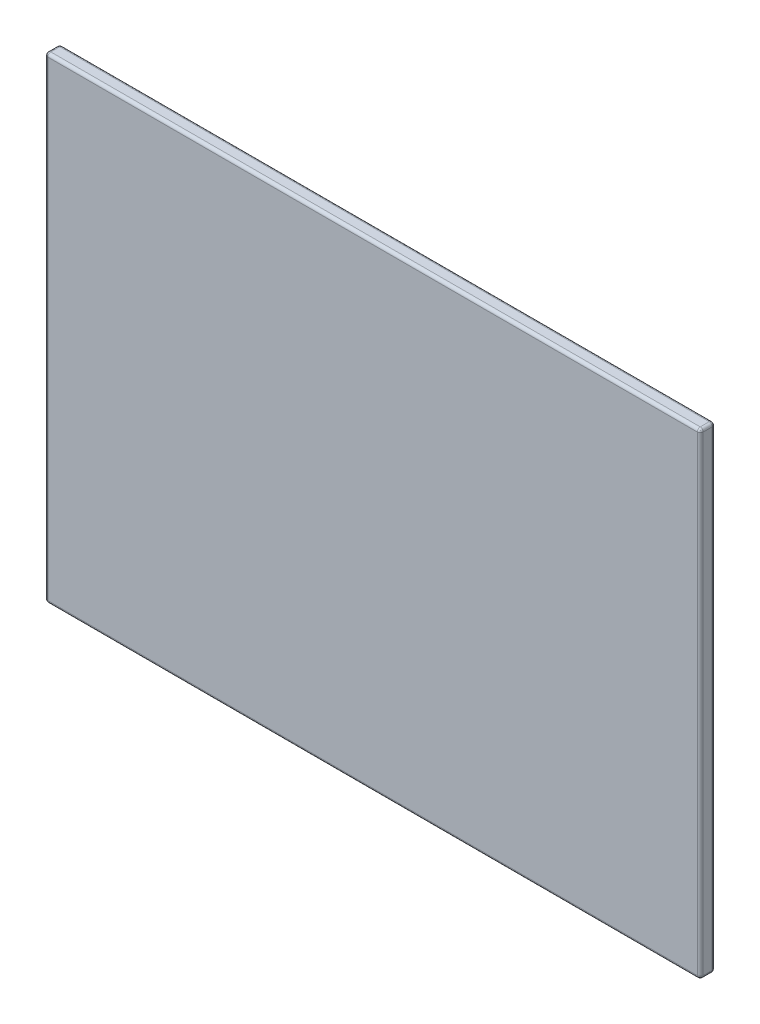
ISO-10303-21;
HEADER;
FILE_DESCRIPTION(('STEP AP214'),'2;1');
FILE_NAME('part.step','',(''),(''),'','','');
FILE_SCHEMA(('AUTOMOTIVE_DESIGN { 1 0 10303 214 1 1 1 1 }'));
ENDSEC;
DATA;
#1=APPLICATION_CONTEXT('core data for automotive mechanical design processes');
#2=APPLICATION_PROTOCOL_DEFINITION('international standard','automotive_design',2000,#1);
#3=PRODUCT_CONTEXT('',#1,'mechanical');
#4=PRODUCT('Part','Part','',(#3));
#5=PRODUCT_RELATED_PRODUCT_CATEGORY('part','',(#4));
#6=PRODUCT_DEFINITION_FORMATION('','',#4);
#7=PRODUCT_DEFINITION_CONTEXT('part definition',#1,'design');
#8=PRODUCT_DEFINITION('design','',#6,#7);
#9=PRODUCT_DEFINITION_SHAPE('','',#8);
#10=(LENGTH_UNIT() NAMED_UNIT(*) SI_UNIT(.MILLI.,.METRE.));
#11=(NAMED_UNIT(*) PLANE_ANGLE_UNIT() SI_UNIT($,.RADIAN.));
#12=(NAMED_UNIT(*) SI_UNIT($,.STERADIAN.) SOLID_ANGLE_UNIT());
#13=UNCERTAINTY_MEASURE_WITH_UNIT(LENGTH_MEASURE(1.E-05),#10,'distance_accuracy_value','');
#14=(GEOMETRIC_REPRESENTATION_CONTEXT(3) GLOBAL_UNCERTAINTY_ASSIGNED_CONTEXT((#13)) GLOBAL_UNIT_ASSIGNED_CONTEXT((#10,
#11,#12)) REPRESENTATION_CONTEXT('',''));
#15=CARTESIAN_POINT('',(0.,0.,0.));
#16=DIRECTION('',(0.,0.,1.));
#17=DIRECTION('',(1.,0.,0.));
#18=AXIS2_PLACEMENT_3D('',#15,#16,#17);
#19=CARTESIAN_POINT('',(-1.09,-0.79,0.04));
#20=DIRECTION('',(-0.577350269189626,-0.577350269189626,0.577350269189626));
#21=DIRECTION('',(0.,0.707106781186548,0.707106781186548));
#22=AXIS2_PLACEMENT_3D('',#19,#20,#21);
#23=SPHERICAL_SURFACE('',#22,0.01);
#24=CARTESIAN_POINT('',(-1.0957735026919,-0.795773502691896,0.0457735026918962));
#25=VERTEX_POINT('',#24);
#26=VERTEX_LOOP('',#25);
#27=FACE_BOUND('',#26,.T.);
#28=CARTESIAN_POINT('',(-1.09,-0.79,0.04));
#29=DIRECTION('',(0.,0.,1.));
#30=DIRECTION('',(1.,0.,0.));
#31=AXIS2_PLACEMENT_3D('',#28,#29,#30);
#32=CIRCLE('',#31,0.01);
#33=CARTESIAN_POINT('',(-1.09,-0.8,0.04));
#34=VERTEX_POINT('',#33);
#35=CARTESIAN_POINT('',(-1.1,-0.79,0.04));
#36=VERTEX_POINT('',#35);
#37=EDGE_CURVE('E111',#34,#36,#32,.F.);
#38=ORIENTED_EDGE('',*,*,#37,.F.);
#39=CARTESIAN_POINT('',(-1.09,-0.79,0.04));
#40=DIRECTION('',(1.,0.,0.));
#41=DIRECTION('',(0.,1.,0.));
#42=AXIS2_PLACEMENT_3D('',#39,#40,#41);
#43=CIRCLE('',#42,0.01);
#44=CARTESIAN_POINT('',(-1.09,-0.79,0.05));
#45=VERTEX_POINT('',#44);
#46=EDGE_CURVE('E122',#45,#34,#43,.T.);
#47=ORIENTED_EDGE('',*,*,#46,.F.);
#48=CARTESIAN_POINT('',(-1.09,-0.79,0.04));
#49=DIRECTION('',(0.,-1.,0.));
#50=DIRECTION('',(1.,0.,0.));
#51=AXIS2_PLACEMENT_3D('',#48,#49,#50);
#52=CIRCLE('',#51,0.01);
#53=EDGE_CURVE('E20',#36,#45,#52,.F.);
#54=ORIENTED_EDGE('',*,*,#53,.F.);
#55=EDGE_LOOP('',(#38,#47,#54));
#56=FACE_BOUND('',#55,.T.);
#57=ADVANCED_FACE('F16',(#27,#56),#23,.T.);
#58=CARTESIAN_POINT('',(1.09,-0.79,0.04));
#59=DIRECTION('',(0.577350269189626,-0.577350269189626,0.577350269189626));
#60=DIRECTION('',(0.,0.707106781186548,0.707106781186548));
#61=AXIS2_PLACEMENT_3D('',#58,#59,#60);
#62=SPHERICAL_SURFACE('',#61,0.01);
#63=CARTESIAN_POINT('',(1.0957735026919,-0.795773502691896,0.0457735026918962));
#64=VERTEX_POINT('',#63);
#65=VERTEX_LOOP('',#64);
#66=FACE_BOUND('',#65,.T.);
#67=CARTESIAN_POINT('',(1.09,-0.79,0.04));
#68=DIRECTION('',(0.,0.,1.));
#69=DIRECTION('',(1.,0.,0.));
#70=AXIS2_PLACEMENT_3D('',#67,#68,#69);
#71=CIRCLE('',#70,0.01);
#72=CARTESIAN_POINT('',(1.1,-0.79,0.04));
#73=VERTEX_POINT('',#72);
#74=CARTESIAN_POINT('',(1.09,-0.8,0.04));
#75=VERTEX_POINT('',#74);
#76=EDGE_CURVE('E223',#73,#75,#71,.F.);
#77=ORIENTED_EDGE('',*,*,#76,.F.);
#78=CARTESIAN_POINT('',(1.09,-0.79,0.04));
#79=DIRECTION('',(0.,1.,0.));
#80=DIRECTION('',(-1.,0.,0.));
#81=AXIS2_PLACEMENT_3D('',#78,#79,#80);
#82=CIRCLE('',#81,0.01);
#83=CARTESIAN_POINT('',(1.09,-0.79,0.05));
#84=VERTEX_POINT('',#83);
#85=EDGE_CURVE('E174',#84,#73,#82,.T.);
#86=ORIENTED_EDGE('',*,*,#85,.F.);
#87=CARTESIAN_POINT('',(1.09,-0.79,0.04));
#88=DIRECTION('',(1.,0.,0.));
#89=DIRECTION('',(0.,1.,0.));
#90=AXIS2_PLACEMENT_3D('',#87,#88,#89);
#91=CIRCLE('',#90,0.01);
#92=EDGE_CURVE('E179',#75,#84,#91,.F.);
#93=ORIENTED_EDGE('',*,*,#92,.F.);
#94=EDGE_LOOP('',(#77,#86,#93));
#95=FACE_BOUND('',#94,.T.);
#96=ADVANCED_FACE('F166',(#66,#95),#62,.T.);
#97=CARTESIAN_POINT('',(-1.09,0.79,0.04));
#98=DIRECTION('',(-0.577350269189626,0.577350269189626,0.577350269189626));
#99=DIRECTION('',(0.,0.707106781186548,-0.707106781186548));
#100=AXIS2_PLACEMENT_3D('',#97,#98,#99);
#101=SPHERICAL_SURFACE('',#100,0.01);
#102=CARTESIAN_POINT('',(-1.0957735026919,0.795773502691896,0.0457735026918962));
#103=VERTEX_POINT('',#102);
#104=VERTEX_LOOP('',#103);
#105=FACE_BOUND('',#104,.T.);
#106=CARTESIAN_POINT('',(-1.09,0.79,0.04));
#107=DIRECTION('',(0.,0.,1.));
#108=DIRECTION('',(1.,0.,0.));
#109=AXIS2_PLACEMENT_3D('',#106,#107,#108);
#110=CIRCLE('',#109,0.01);
#111=CARTESIAN_POINT('',(-1.1,0.79,0.04));
#112=VERTEX_POINT('',#111);
#113=CARTESIAN_POINT('',(-1.09,0.8,0.04));
#114=VERTEX_POINT('',#113);
#115=EDGE_CURVE('E221',#112,#114,#110,.F.);
#116=ORIENTED_EDGE('',*,*,#115,.F.);
#117=CARTESIAN_POINT('',(-1.09,0.79,0.04));
#118=DIRECTION('',(0.,-1.,0.));
#119=DIRECTION('',(1.,0.,0.));
#120=AXIS2_PLACEMENT_3D('',#117,#118,#119);
#121=CIRCLE('',#120,0.01);
#122=CARTESIAN_POINT('',(-1.09,0.79,0.05));
#123=VERTEX_POINT('',#122);
#124=EDGE_CURVE('E140',#123,#112,#121,.T.);
#125=ORIENTED_EDGE('',*,*,#124,.F.);
#126=CARTESIAN_POINT('',(-1.09,0.79,0.04));
#127=DIRECTION('',(-1.,0.,0.));
#128=DIRECTION('',(0.,-1.,0.));
#129=AXIS2_PLACEMENT_3D('',#126,#127,#128);
#130=CIRCLE('',#129,0.01);
#131=EDGE_CURVE('E218',#114,#123,#130,.F.);
#132=ORIENTED_EDGE('',*,*,#131,.F.);
#133=EDGE_LOOP('',(#116,#125,#132));
#134=FACE_BOUND('',#133,.T.);
#135=ADVANCED_FACE('F163',(#105,#134),#101,.T.);
#136=CARTESIAN_POINT('',(0.,0.,0.05));
#137=DIRECTION('',(0.,0.,1.));
#138=DIRECTION('',(1.,0.,0.));
#139=AXIS2_PLACEMENT_3D('',#136,#137,#138);
#140=PLANE('',#139);
#141=DIRECTION('',(0.,1.,0.));
#142=VECTOR('',#141,1.);
#143=CARTESIAN_POINT('',(1.09,-0.4,0.05));
#144=LINE('',#143,#142);
#145=CARTESIAN_POINT('',(1.09,0.79,0.05));
#146=VERTEX_POINT('',#145);
#147=EDGE_CURVE('E172',#146,#84,#144,.F.);
#148=ORIENTED_EDGE('',*,*,#147,.F.);
#149=DIRECTION('',(-1.,0.,0.));
#150=VECTOR('',#149,1.);
#151=CARTESIAN_POINT('',(0.55,0.79,0.05));
#152=LINE('',#151,#150);
#153=EDGE_CURVE('E151',#123,#146,#152,.F.);
#154=ORIENTED_EDGE('',*,*,#153,.F.);
#155=DIRECTION('',(0.,-1.,0.));
#156=VECTOR('',#155,1.);
#157=CARTESIAN_POINT('',(-1.09,0.4,0.05));
#158=LINE('',#157,#156);
#159=EDGE_CURVE('E137',#45,#123,#158,.F.);
#160=ORIENTED_EDGE('',*,*,#159,.F.);
#161=DIRECTION('',(1.,0.,0.));
#162=VECTOR('',#161,1.);
#163=CARTESIAN_POINT('',(-0.55,-0.79,0.05));
#164=LINE('',#163,#162);
#165=EDGE_CURVE('E177',#84,#45,#164,.F.);
#166=ORIENTED_EDGE('',*,*,#165,.F.);
#167=EDGE_LOOP('',(#148,#154,#160,#166));
#168=FACE_BOUND('',#167,.T.);
#169=ADVANCED_FACE('F158',(#168),#140,.T.);
#170=CARTESIAN_POINT('',(1.09,0.79,0.04));
#171=DIRECTION('',(0.577350269189626,0.577350269189626,0.577350269189626));
#172=DIRECTION('',(0.,0.707106781186548,-0.707106781186548));
#173=AXIS2_PLACEMENT_3D('',#170,#171,#172);
#174=SPHERICAL_SURFACE('',#173,0.01);
#175=CARTESIAN_POINT('',(1.0957735026919,0.795773502691896,0.0457735026918962));
#176=VERTEX_POINT('',#175);
#177=VERTEX_LOOP('',#176);
#178=FACE_BOUND('',#177,.T.);
#179=CARTESIAN_POINT('',(1.09,0.79,0.04));
#180=DIRECTION('',(0.,0.,1.));
#181=DIRECTION('',(1.,0.,0.));
#182=AXIS2_PLACEMENT_3D('',#179,#180,#181);
#183=CIRCLE('',#182,0.01);
#184=CARTESIAN_POINT('',(1.09,0.8,0.04));
#185=VERTEX_POINT('',#184);
#186=CARTESIAN_POINT('',(1.1,0.79,0.04));
#187=VERTEX_POINT('',#186);
#188=EDGE_CURVE('E132',#185,#187,#183,.F.);
#189=ORIENTED_EDGE('',*,*,#188,.F.);
#190=CARTESIAN_POINT('',(1.09,0.79,0.04));
#191=DIRECTION('',(-1.,0.,0.));
#192=DIRECTION('',(0.,-1.,0.));
#193=AXIS2_PLACEMENT_3D('',#190,#191,#192);
#194=CIRCLE('',#193,0.01);
#195=EDGE_CURVE('E216',#146,#185,#194,.T.);
#196=ORIENTED_EDGE('',*,*,#195,.F.);
#197=CARTESIAN_POINT('',(1.09,0.79,0.04));
#198=DIRECTION('',(0.,1.,0.));
#199=DIRECTION('',(-1.,0.,0.));
#200=AXIS2_PLACEMENT_3D('',#197,#198,#199);
#201=CIRCLE('',#200,0.01);
#202=EDGE_CURVE('E121',#187,#146,#201,.F.);
#203=ORIENTED_EDGE('',*,*,#202,.F.);
#204=EDGE_LOOP('',(#189,#196,#203));
#205=FACE_BOUND('',#204,.T.);
#206=ADVANCED_FACE('F154',(#178,#205),#174,.T.);
#207=CARTESIAN_POINT('',(-1.09,0.4,0.04));
#208=DIRECTION('',(0.,-1.,0.));
#209=DIRECTION('',(1.,0.,0.));
#210=AXIS2_PLACEMENT_3D('',#207,#208,#209);
#211=CYLINDRICAL_SURFACE('',#210,0.01);
#212=ORIENTED_EDGE('',*,*,#124,.T.);
#213=DIRECTION('',(0.,-1.,0.));
#214=VECTOR('',#213,1.);
#215=CARTESIAN_POINT('',(-1.1,0.8,0.04));
#216=LINE('',#215,#214);
#217=EDGE_CURVE('E128',#36,#112,#216,.F.);
#218=ORIENTED_EDGE('',*,*,#217,.F.);
#219=ORIENTED_EDGE('',*,*,#53,.T.);
#220=ORIENTED_EDGE('',*,*,#159,.T.);
#221=EDGE_LOOP('',(#212,#218,#219,#220));
#222=FACE_BOUND('',#221,.T.);
#223=ADVANCED_FACE('F138',(#222),#211,.T.);
#224=CARTESIAN_POINT('',(-0.55,-0.79,0.04));
#225=DIRECTION('',(1.,0.,0.));
#226=DIRECTION('',(0.,1.,0.));
#227=AXIS2_PLACEMENT_3D('',#224,#225,#226);
#228=CYLINDRICAL_SURFACE('',#227,0.01);
#229=ORIENTED_EDGE('',*,*,#46,.T.);
#230=DIRECTION('',(1.,0.,0.));
#231=VECTOR('',#230,1.);
#232=CARTESIAN_POINT('',(-1.1,-0.8,0.04));
#233=LINE('',#232,#231);
#234=EDGE_CURVE('E147',#75,#34,#233,.F.);
#235=ORIENTED_EDGE('',*,*,#234,.F.);
#236=ORIENTED_EDGE('',*,*,#92,.T.);
#237=ORIENTED_EDGE('',*,*,#165,.T.);
#238=EDGE_LOOP('',(#229,#235,#236,#237));
#239=FACE_BOUND('',#238,.T.);
#240=ADVANCED_FACE('F232',(#239),#228,.T.);
#241=CARTESIAN_POINT('',(-1.09,-0.79,0.));
#242=DIRECTION('',(0.,0.,1.));
#243=DIRECTION('',(1.,0.,0.));
#244=AXIS2_PLACEMENT_3D('',#241,#242,#243);
#245=CYLINDRICAL_SURFACE('',#244,0.01);
#246=CARTESIAN_POINT('',(-1.09,-0.79,0.01));
#247=DIRECTION('',(0.,0.,1.));
#248=DIRECTION('',(1.,0.,0.));
#249=AXIS2_PLACEMENT_3D('',#246,#247,#248);
#250=CIRCLE('',#249,0.01);
#251=CARTESIAN_POINT('',(-1.09,-0.8,0.01));
#252=VERTEX_POINT('',#251);
#253=CARTESIAN_POINT('',(-1.1,-0.79,0.01));
#254=VERTEX_POINT('',#253);
#255=EDGE_CURVE('E143',#252,#254,#250,.F.);
#256=ORIENTED_EDGE('',*,*,#255,.F.);
#257=DIRECTION('',(0.,0.,1.));
#258=VECTOR('',#257,1.);
#259=CARTESIAN_POINT('',(-1.09,-0.8,0.));
#260=LINE('',#259,#258);
#261=EDGE_CURVE('E117',#34,#252,#260,.F.);
#262=ORIENTED_EDGE('',*,*,#261,.F.);
#263=ORIENTED_EDGE('',*,*,#37,.T.);
#264=DIRECTION('',(0.,0.,1.));
#265=VECTOR('',#264,1.);
#266=CARTESIAN_POINT('',(-1.1,-0.79,0.));
#267=LINE('',#266,#265);
#268=EDGE_CURVE('E115',#254,#36,#267,.T.);
#269=ORIENTED_EDGE('',*,*,#268,.F.);
#270=EDGE_LOOP('',(#256,#262,#263,#269));
#271=FACE_BOUND('',#270,.T.);
#272=ADVANCED_FACE('F114',(#271),#245,.T.);
#273=CARTESIAN_POINT('',(1.09,-0.4,0.04));
#274=DIRECTION('',(0.,1.,0.));
#275=DIRECTION('',(-1.,0.,0.));
#276=AXIS2_PLACEMENT_3D('',#273,#274,#275);
#277=CYLINDRICAL_SURFACE('',#276,0.01);
#278=ORIENTED_EDGE('',*,*,#85,.T.);
#279=DIRECTION('',(0.,1.,0.));
#280=VECTOR('',#279,1.);
#281=CARTESIAN_POINT('',(1.1,-0.8,0.04));
#282=LINE('',#281,#280);
#283=EDGE_CURVE('E317',#187,#73,#282,.F.);
#284=ORIENTED_EDGE('',*,*,#283,.F.);
#285=ORIENTED_EDGE('',*,*,#202,.T.);
#286=ORIENTED_EDGE('',*,*,#147,.T.);
#287=EDGE_LOOP('',(#278,#284,#285,#286));
#288=FACE_BOUND('',#287,.T.);
#289=ADVANCED_FACE('F243',(#288),#277,.T.);
#290=CARTESIAN_POINT('',(1.09,-0.79,0.));
#291=DIRECTION('',(0.,0.,1.));
#292=DIRECTION('',(1.,0.,0.));
#293=AXIS2_PLACEMENT_3D('',#290,#291,#292);
#294=CYLINDRICAL_SURFACE('',#293,0.01);
#295=CARTESIAN_POINT('',(1.09,-0.79,0.01));
#296=DIRECTION('',(0.,0.,1.));
#297=DIRECTION('',(1.,0.,0.));
#298=AXIS2_PLACEMENT_3D('',#295,#296,#297);
#299=CIRCLE('',#298,0.01);
#300=CARTESIAN_POINT('',(1.1,-0.79,0.01));
#301=VERTEX_POINT('',#300);
#302=CARTESIAN_POINT('',(1.09,-0.8,0.01));
#303=VERTEX_POINT('',#302);
#304=EDGE_CURVE('E210',#301,#303,#299,.F.);
#305=ORIENTED_EDGE('',*,*,#304,.F.);
#306=DIRECTION('',(0.,0.,1.));
#307=VECTOR('',#306,1.);
#308=CARTESIAN_POINT('',(1.1,-0.79,0.));
#309=LINE('',#308,#307);
#310=EDGE_CURVE('E209',#73,#301,#309,.F.);
#311=ORIENTED_EDGE('',*,*,#310,.F.);
#312=ORIENTED_EDGE('',*,*,#76,.T.);
#313=DIRECTION('',(0.,0.,1.));
#314=VECTOR('',#313,1.);
#315=CARTESIAN_POINT('',(1.09,-0.8,0.));
#316=LINE('',#315,#314);
#317=EDGE_CURVE('E214',#303,#75,#316,.T.);
#318=ORIENTED_EDGE('',*,*,#317,.F.);
#319=EDGE_LOOP('',(#305,#311,#312,#318));
#320=FACE_BOUND('',#319,.T.);
#321=ADVANCED_FACE('F351',(#320),#294,.T.);
#322=CARTESIAN_POINT('',(-1.09,0.79,0.));
#323=DIRECTION('',(0.,0.,1.));
#324=DIRECTION('',(1.,0.,0.));
#325=AXIS2_PLACEMENT_3D('',#322,#323,#324);
#326=CYLINDRICAL_SURFACE('',#325,0.01);
#327=CARTESIAN_POINT('',(-1.09,0.79,0.01));
#328=DIRECTION('',(0.,0.,1.));
#329=DIRECTION('',(1.,0.,0.));
#330=AXIS2_PLACEMENT_3D('',#327,#328,#329);
#331=CIRCLE('',#330,0.01);
#332=CARTESIAN_POINT('',(-1.1,0.79,0.01));
#333=VERTEX_POINT('',#332);
#334=CARTESIAN_POINT('',(-1.09,0.8,0.01));
#335=VERTEX_POINT('',#334);
#336=EDGE_CURVE('E204',#333,#335,#331,.F.);
#337=ORIENTED_EDGE('',*,*,#336,.F.);
#338=DIRECTION('',(0.,0.,1.));
#339=VECTOR('',#338,1.);
#340=CARTESIAN_POINT('',(-1.1,0.79,0.));
#341=LINE('',#340,#339);
#342=EDGE_CURVE('E141',#112,#333,#341,.F.);
#343=ORIENTED_EDGE('',*,*,#342,.F.);
#344=ORIENTED_EDGE('',*,*,#115,.T.);
#345=DIRECTION('',(0.,0.,1.));
#346=VECTOR('',#345,1.);
#347=CARTESIAN_POINT('',(-1.09,0.8,0.));
#348=LINE('',#347,#346);
#349=EDGE_CURVE('E206',#335,#114,#348,.T.);
#350=ORIENTED_EDGE('',*,*,#349,.F.);
#351=EDGE_LOOP('',(#337,#343,#344,#350));
#352=FACE_BOUND('',#351,.T.);
#353=ADVANCED_FACE('F373',(#352),#326,.T.);
#354=CARTESIAN_POINT('',(0.55,0.79,0.04));
#355=DIRECTION('',(-1.,0.,0.));
#356=DIRECTION('',(0.,-1.,0.));
#357=AXIS2_PLACEMENT_3D('',#354,#355,#356);
#358=CYLINDRICAL_SURFACE('',#357,0.01);
#359=ORIENTED_EDGE('',*,*,#195,.T.);
#360=DIRECTION('',(-1.,0.,0.));
#361=VECTOR('',#360,1.);
#362=CARTESIAN_POINT('',(1.1,0.8,0.04));
#363=LINE('',#362,#361);
#364=EDGE_CURVE('E309',#114,#185,#363,.F.);
#365=ORIENTED_EDGE('',*,*,#364,.F.);
#366=ORIENTED_EDGE('',*,*,#131,.T.);
#367=ORIENTED_EDGE('',*,*,#153,.T.);
#368=EDGE_LOOP('',(#359,#365,#366,#367));
#369=FACE_BOUND('',#368,.T.);
#370=ADVANCED_FACE('F420',(#369),#358,.T.);
#371=CARTESIAN_POINT('',(1.09,0.79,0.));
#372=DIRECTION('',(0.,0.,1.));
#373=DIRECTION('',(1.,0.,0.));
#374=AXIS2_PLACEMENT_3D('',#371,#372,#373);
#375=CYLINDRICAL_SURFACE('',#374,0.01);
#376=CARTESIAN_POINT('',(1.09,0.79,0.01));
#377=DIRECTION('',(0.,0.,1.));
#378=DIRECTION('',(1.,0.,0.));
#379=AXIS2_PLACEMENT_3D('',#376,#377,#378);
#380=CIRCLE('',#379,0.01);
#381=CARTESIAN_POINT('',(1.09,0.8,0.01));
#382=VERTEX_POINT('',#381);
#383=CARTESIAN_POINT('',(1.1,0.79,0.01));
#384=VERTEX_POINT('',#383);
#385=EDGE_CURVE('E207',#382,#384,#380,.F.);
#386=ORIENTED_EDGE('',*,*,#385,.F.);
#387=DIRECTION('',(0.,0.,1.));
#388=VECTOR('',#387,1.);
#389=CARTESIAN_POINT('',(1.09,0.8,0.));
#390=LINE('',#389,#388);
#391=EDGE_CURVE('E203',#185,#382,#390,.F.);
#392=ORIENTED_EDGE('',*,*,#391,.F.);
#393=ORIENTED_EDGE('',*,*,#188,.T.);
#394=DIRECTION('',(0.,0.,1.));
#395=VECTOR('',#394,1.);
#396=CARTESIAN_POINT('',(1.1,0.79,0.));
#397=LINE('',#396,#395);
#398=EDGE_CURVE('E212',#384,#187,#397,.T.);
#399=ORIENTED_EDGE('',*,*,#398,.F.);
#400=EDGE_LOOP('',(#386,#392,#393,#399));
#401=FACE_BOUND('',#400,.T.);
#402=ADVANCED_FACE('F381',(#401),#375,.T.);
#403=CARTESIAN_POINT('',(-1.1,0.8,0.));
#404=DIRECTION('',(-1.,0.,0.));
#405=DIRECTION('',(0.,-1.,0.));
#406=AXIS2_PLACEMENT_3D('',#403,#404,#405);
#407=PLANE('',#406);
#408=ORIENTED_EDGE('',*,*,#342,.T.);
#409=DIRECTION('',(0.,1.,0.));
#410=VECTOR('',#409,1.);
#411=CARTESIAN_POINT('',(-1.1,0.4,0.01));
#412=LINE('',#411,#410);
#413=EDGE_CURVE('E131',#254,#333,#412,.T.);
#414=ORIENTED_EDGE('',*,*,#413,.F.);
#415=ORIENTED_EDGE('',*,*,#268,.T.);
#416=ORIENTED_EDGE('',*,*,#217,.T.);
#417=EDGE_LOOP('',(#408,#414,#415,#416));
#418=FACE_BOUND('',#417,.T.);
#419=ADVANCED_FACE('F126',(#418),#407,.T.);
#420=CARTESIAN_POINT('',(-1.09,-0.79,0.01));
#421=DIRECTION('',(-0.577350269189626,-0.577350269189626,-0.577350269189626));
#422=DIRECTION('',(0.,-0.707106781186548,0.707106781186548));
#423=AXIS2_PLACEMENT_3D('',#420,#421,#422);
#424=SPHERICAL_SURFACE('',#423,0.01);
#425=CARTESIAN_POINT('',(-1.0957735026919,-0.795773502691896,0.00422649730810376));
#426=VERTEX_POINT('',#425);
#427=VERTEX_LOOP('',#426);
#428=FACE_BOUND('',#427,.T.);
#429=CARTESIAN_POINT('',(-1.09,-0.79,0.01));
#430=DIRECTION('',(-1.,0.,0.));
#431=DIRECTION('',(0.,-1.,0.));
#432=AXIS2_PLACEMENT_3D('',#429,#430,#431);
#433=CIRCLE('',#432,0.01);
#434=CARTESIAN_POINT('',(-1.09,-0.79,0.));
#435=VERTEX_POINT('',#434);
#436=EDGE_CURVE('E196',#252,#435,#433,.F.);
#437=ORIENTED_EDGE('',*,*,#436,.F.);
#438=ORIENTED_EDGE('',*,*,#255,.T.);
#439=CARTESIAN_POINT('',(-1.09,-0.79,0.01));
#440=DIRECTION('',(0.,1.,0.));
#441=DIRECTION('',(-1.,0.,0.));
#442=AXIS2_PLACEMENT_3D('',#439,#440,#441);
#443=CIRCLE('',#442,0.01);
#444=EDGE_CURVE('E198',#435,#254,#443,.T.);
#445=ORIENTED_EDGE('',*,*,#444,.F.);
#446=EDGE_LOOP('',(#437,#438,#445));
#447=FACE_BOUND('',#446,.T.);
#448=ADVANCED_FACE('F332',(#428,#447),#424,.T.);
#449=CARTESIAN_POINT('',(-1.1,-0.8,0.));
#450=DIRECTION('',(0.,-1.,0.));
#451=DIRECTION('',(1.,0.,0.));
#452=AXIS2_PLACEMENT_3D('',#449,#450,#451);
#453=PLANE('',#452);
#454=ORIENTED_EDGE('',*,*,#234,.T.);
#455=ORIENTED_EDGE('',*,*,#261,.T.);
#456=DIRECTION('',(-1.,0.,0.));
#457=VECTOR('',#456,1.);
#458=CARTESIAN_POINT('',(-0.55,-0.8,0.01));
#459=LINE('',#458,#457);
#460=EDGE_CURVE('E192',#303,#252,#459,.T.);
#461=ORIENTED_EDGE('',*,*,#460,.F.);
#462=ORIENTED_EDGE('',*,*,#317,.T.);
#463=EDGE_LOOP('',(#454,#455,#461,#462));
#464=FACE_BOUND('',#463,.T.);
#465=ADVANCED_FACE('F328',(#464),#453,.T.);
#466=CARTESIAN_POINT('',(1.09,-0.79,0.01));
#467=DIRECTION('',(0.577350269189626,-0.577350269189626,-0.577350269189626));
#468=DIRECTION('',(0.,-0.707106781186548,0.707106781186548));
#469=AXIS2_PLACEMENT_3D('',#466,#467,#468);
#470=SPHERICAL_SURFACE('',#469,0.01);
#471=CARTESIAN_POINT('',(1.0957735026919,-0.795773502691896,0.00422649730810376));
#472=VERTEX_POINT('',#471);
#473=VERTEX_LOOP('',#472);
#474=FACE_BOUND('',#473,.T.);
#475=CARTESIAN_POINT('',(1.09,-0.79,0.01));
#476=DIRECTION('',(0.,-1.,0.));
#477=DIRECTION('',(1.,0.,0.));
#478=AXIS2_PLACEMENT_3D('',#475,#476,#477);
#479=CIRCLE('',#478,0.01);
#480=CARTESIAN_POINT('',(1.09,-0.79,0.));
#481=VERTEX_POINT('',#480);
#482=EDGE_CURVE('E190',#301,#481,#479,.F.);
#483=ORIENTED_EDGE('',*,*,#482,.F.);
#484=ORIENTED_EDGE('',*,*,#304,.T.);
#485=CARTESIAN_POINT('',(1.09,-0.79,0.01));
#486=DIRECTION('',(-1.,0.,0.));
#487=DIRECTION('',(0.,-1.,0.));
#488=AXIS2_PLACEMENT_3D('',#485,#486,#487);
#489=CIRCLE('',#488,0.01);
#490=EDGE_CURVE('E193',#481,#303,#489,.T.);
#491=ORIENTED_EDGE('',*,*,#490,.F.);
#492=EDGE_LOOP('',(#483,#484,#491));
#493=FACE_BOUND('',#492,.T.);
#494=ADVANCED_FACE('F324',(#474,#493),#470,.T.);
#495=CARTESIAN_POINT('',(1.1,-0.8,0.));
#496=DIRECTION('',(1.,0.,0.));
#497=DIRECTION('',(0.,1.,0.));
#498=AXIS2_PLACEMENT_3D('',#495,#496,#497);
#499=PLANE('',#498);
#500=ORIENTED_EDGE('',*,*,#310,.T.);
#501=DIRECTION('',(0.,-1.,0.));
#502=VECTOR('',#501,1.);
#503=CARTESIAN_POINT('',(1.1,-0.4,0.01));
#504=LINE('',#503,#502);
#505=EDGE_CURVE('E186',#384,#301,#504,.T.);
#506=ORIENTED_EDGE('',*,*,#505,.F.);
#507=ORIENTED_EDGE('',*,*,#398,.T.);
#508=ORIENTED_EDGE('',*,*,#283,.T.);
#509=EDGE_LOOP('',(#500,#506,#507,#508));
#510=FACE_BOUND('',#509,.T.);
#511=ADVANCED_FACE('F327',(#510),#499,.T.);
#512=CARTESIAN_POINT('',(1.09,0.79,0.01));
#513=DIRECTION('',(0.577350269189626,0.577350269189626,-0.577350269189626));
#514=DIRECTION('',(0.,-0.707106781186548,-0.707106781186548));
#515=AXIS2_PLACEMENT_3D('',#512,#513,#514);
#516=SPHERICAL_SURFACE('',#515,0.01);
#517=CARTESIAN_POINT('',(1.0957735026919,0.795773502691896,0.00422649730810376));
#518=VERTEX_POINT('',#517);
#519=VERTEX_LOOP('',#518);
#520=FACE_BOUND('',#519,.T.);
#521=CARTESIAN_POINT('',(1.09,0.79,0.01));
#522=DIRECTION('',(1.,0.,0.));
#523=DIRECTION('',(0.,1.,0.));
#524=AXIS2_PLACEMENT_3D('',#521,#522,#523);
#525=CIRCLE('',#524,0.01);
#526=CARTESIAN_POINT('',(1.09,0.79,0.));
#527=VERTEX_POINT('',#526);
#528=EDGE_CURVE('E34',#382,#527,#525,.F.);
#529=ORIENTED_EDGE('',*,*,#528,.F.);
#530=ORIENTED_EDGE('',*,*,#385,.T.);
#531=CARTESIAN_POINT('',(1.09,0.79,0.01));
#532=DIRECTION('',(0.,-1.,0.));
#533=DIRECTION('',(1.,0.,0.));
#534=AXIS2_PLACEMENT_3D('',#531,#532,#533);
#535=CIRCLE('',#534,0.01);
#536=EDGE_CURVE('E187',#527,#384,#535,.T.);
#537=ORIENTED_EDGE('',*,*,#536,.F.);
#538=EDGE_LOOP('',(#529,#530,#537));
#539=FACE_BOUND('',#538,.T.);
#540=ADVANCED_FACE('F297',(#520,#539),#516,.T.);
#541=CARTESIAN_POINT('',(-1.09,0.79,0.01));
#542=DIRECTION('',(-0.577350269189626,0.577350269189626,-0.577350269189626));
#543=DIRECTION('',(0.707106781186548,0.707106781186548,0.));
#544=AXIS2_PLACEMENT_3D('',#541,#542,#543);
#545=SPHERICAL_SURFACE('',#544,0.01);
#546=CARTESIAN_POINT('',(-1.0957735026919,0.795773502691896,0.00422649730810376));
#547=VERTEX_POINT('',#546);
#548=VERTEX_LOOP('',#547);
#549=FACE_BOUND('',#548,.T.);
#550=CARTESIAN_POINT('',(-1.09,0.79,0.01));
#551=DIRECTION('',(1.,0.,0.));
#552=DIRECTION('',(0.,1.,0.));
#553=AXIS2_PLACEMENT_3D('',#550,#551,#552);
#554=CIRCLE('',#553,0.01);
#555=CARTESIAN_POINT('',(-1.09,0.79,0.));
#556=VERTEX_POINT('',#555);
#557=EDGE_CURVE('E181',#556,#335,#554,.T.);
#558=ORIENTED_EDGE('',*,*,#557,.F.);
#559=CARTESIAN_POINT('',(-1.09,0.79,0.01));
#560=DIRECTION('',(0.,1.,0.));
#561=DIRECTION('',(-1.,0.,0.));
#562=AXIS2_PLACEMENT_3D('',#559,#560,#561);
#563=CIRCLE('',#562,0.01);
#564=EDGE_CURVE('E201',#333,#556,#563,.F.);
#565=ORIENTED_EDGE('',*,*,#564,.F.);
#566=ORIENTED_EDGE('',*,*,#336,.T.);
#567=EDGE_LOOP('',(#558,#565,#566));
#568=FACE_BOUND('',#567,.T.);
#569=ADVANCED_FACE('F292',(#549,#568),#545,.T.);
#570=CARTESIAN_POINT('',(1.1,0.8,0.));
#571=DIRECTION('',(0.,1.,0.));
#572=DIRECTION('',(-1.,0.,0.));
#573=AXIS2_PLACEMENT_3D('',#570,#571,#572);
#574=PLANE('',#573);
#575=ORIENTED_EDGE('',*,*,#364,.T.);
#576=ORIENTED_EDGE('',*,*,#391,.T.);
#577=DIRECTION('',(1.,0.,0.));
#578=VECTOR('',#577,1.);
#579=CARTESIAN_POINT('',(0.55,0.8,0.01));
#580=LINE('',#579,#578);
#581=EDGE_CURVE('E184',#335,#382,#580,.T.);
#582=ORIENTED_EDGE('',*,*,#581,.F.);
#583=ORIENTED_EDGE('',*,*,#349,.T.);
#584=EDGE_LOOP('',(#575,#576,#582,#583));
#585=FACE_BOUND('',#584,.T.);
#586=ADVANCED_FACE('F288',(#585),#574,.T.);
#587=CARTESIAN_POINT('',(-1.09,0.4,0.01));
#588=DIRECTION('',(0.,1.,0.));
#589=DIRECTION('',(-1.,0.,0.));
#590=AXIS2_PLACEMENT_3D('',#587,#588,#589);
#591=CYLINDRICAL_SURFACE('',#590,0.01);
#592=ORIENTED_EDGE('',*,*,#444,.T.);
#593=ORIENTED_EDGE('',*,*,#413,.T.);
#594=ORIENTED_EDGE('',*,*,#564,.T.);
#595=DIRECTION('',(0.,1.,0.));
#596=VECTOR('',#595,1.);
#597=CARTESIAN_POINT('',(-1.09,0.,0.));
#598=LINE('',#597,#596);
#599=EDGE_CURVE('E303',#556,#435,#598,.F.);
#600=ORIENTED_EDGE('',*,*,#599,.T.);
#601=EDGE_LOOP('',(#592,#593,#594,#600));
#602=FACE_BOUND('',#601,.T.);
#603=ADVANCED_FACE('F284',(#602),#591,.T.);
#604=CARTESIAN_POINT('',(-0.55,-0.79,0.01));
#605=DIRECTION('',(-1.,0.,0.));
#606=DIRECTION('',(0.,-1.,0.));
#607=AXIS2_PLACEMENT_3D('',#604,#605,#606);
#608=CYLINDRICAL_SURFACE('',#607,0.01);
#609=ORIENTED_EDGE('',*,*,#490,.T.);
#610=ORIENTED_EDGE('',*,*,#460,.T.);
#611=ORIENTED_EDGE('',*,*,#436,.T.);
#612=DIRECTION('',(1.,0.,0.));
#613=VECTOR('',#612,1.);
#614=CARTESIAN_POINT('',(0.,-0.79,0.));
#615=LINE('',#614,#613);
#616=EDGE_CURVE('E305',#435,#481,#615,.T.);
#617=ORIENTED_EDGE('',*,*,#616,.T.);
#618=EDGE_LOOP('',(#609,#610,#611,#617));
#619=FACE_BOUND('',#618,.T.);
#620=ADVANCED_FACE('F280',(#619),#608,.T.);
#621=CARTESIAN_POINT('',(1.09,-0.4,0.01));
#622=DIRECTION('',(0.,-1.,0.));
#623=DIRECTION('',(1.,0.,0.));
#624=AXIS2_PLACEMENT_3D('',#621,#622,#623);
#625=CYLINDRICAL_SURFACE('',#624,0.01);
#626=ORIENTED_EDGE('',*,*,#536,.T.);
#627=ORIENTED_EDGE('',*,*,#505,.T.);
#628=ORIENTED_EDGE('',*,*,#482,.T.);
#629=DIRECTION('',(0.,1.,0.));
#630=VECTOR('',#629,1.);
#631=CARTESIAN_POINT('',(1.09,0.,0.));
#632=LINE('',#631,#630);
#633=EDGE_CURVE('E26',#481,#527,#632,.T.);
#634=ORIENTED_EDGE('',*,*,#633,.T.);
#635=EDGE_LOOP('',(#626,#627,#628,#634));
#636=FACE_BOUND('',#635,.T.);
#637=ADVANCED_FACE('F274',(#636),#625,.T.);
#638=CARTESIAN_POINT('',(0.55,0.79,0.01));
#639=DIRECTION('',(1.,0.,0.));
#640=DIRECTION('',(0.,1.,0.));
#641=AXIS2_PLACEMENT_3D('',#638,#639,#640);
#642=CYLINDRICAL_SURFACE('',#641,0.01);
#643=ORIENTED_EDGE('',*,*,#557,.T.);
#644=ORIENTED_EDGE('',*,*,#581,.T.);
#645=ORIENTED_EDGE('',*,*,#528,.T.);
#646=DIRECTION('',(1.,0.,0.));
#647=VECTOR('',#646,1.);
#648=CARTESIAN_POINT('',(0.,0.79,0.));
#649=LINE('',#648,#647);
#650=EDGE_CURVE('E10',#527,#556,#649,.F.);
#651=ORIENTED_EDGE('',*,*,#650,.T.);
#652=EDGE_LOOP('',(#643,#644,#645,#651));
#653=FACE_BOUND('',#652,.T.);
#654=ADVANCED_FACE('F268',(#653),#642,.T.);
#655=CARTESIAN_POINT('',(0.,0.,0.));
#656=DIRECTION('',(0.,0.,1.));
#657=DIRECTION('',(1.,0.,0.));
#658=AXIS2_PLACEMENT_3D('',#655,#656,#657);
#659=PLANE('',#658);
#660=ORIENTED_EDGE('',*,*,#633,.F.);
#661=ORIENTED_EDGE('',*,*,#616,.F.);
#662=ORIENTED_EDGE('',*,*,#599,.F.);
#663=ORIENTED_EDGE('',*,*,#650,.F.);
#664=EDGE_LOOP('',(#660,#661,#662,#663));
#665=FACE_BOUND('',#664,.T.);
#666=ADVANCED_FACE('F266',(#665),#659,.F.);
#667=CLOSED_SHELL('',(#57,#96,#135,#169,#206,#223,#240,#272,#289,#321,#353,#370,#402,#419,#448,
#465,#494,#511,#540,#569,#586,#603,#620,#637,#654,#666));
#668=MANIFOLD_SOLID_BREP('B1',#667);
#669=ADVANCED_BREP_SHAPE_REPRESENTATION('',(#18,#668),#14);
#670=SHAPE_DEFINITION_REPRESENTATION(#9,#669);
ENDSEC;
END-ISO-10303-21;
